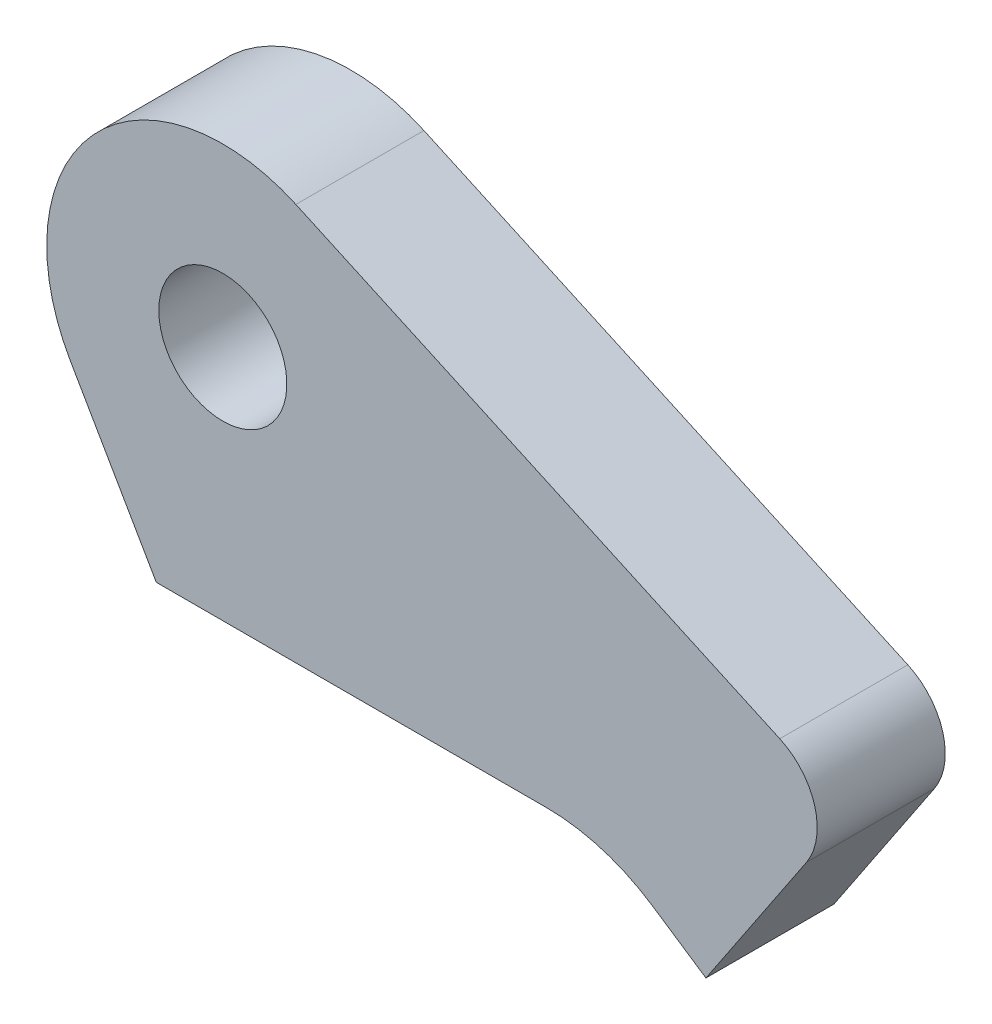
ISO-10303-21;
HEADER;
FILE_DESCRIPTION(('STEP AP214'),'2;1');
FILE_NAME('part.step','',(''),(''),'','','');
FILE_SCHEMA(('AUTOMOTIVE_DESIGN { 1 0 10303 214 1 1 1 1 }'));
ENDSEC;
DATA;
#1=APPLICATION_CONTEXT('core data for automotive mechanical design processes');
#2=APPLICATION_PROTOCOL_DEFINITION('international standard','automotive_design',2000,#1);
#3=PRODUCT_CONTEXT('',#1,'mechanical');
#4=PRODUCT('Part','Part','',(#3));
#5=PRODUCT_RELATED_PRODUCT_CATEGORY('part','',(#4));
#6=PRODUCT_DEFINITION_FORMATION('','',#4);
#7=PRODUCT_DEFINITION_CONTEXT('part definition',#1,'design');
#8=PRODUCT_DEFINITION('design','',#6,#7);
#9=PRODUCT_DEFINITION_SHAPE('','',#8);
#10=(LENGTH_UNIT() NAMED_UNIT(*) SI_UNIT(.MILLI.,.METRE.));
#11=(NAMED_UNIT(*) PLANE_ANGLE_UNIT() SI_UNIT($,.RADIAN.));
#12=(NAMED_UNIT(*) SI_UNIT($,.STERADIAN.) SOLID_ANGLE_UNIT());
#13=UNCERTAINTY_MEASURE_WITH_UNIT(LENGTH_MEASURE(1.E-05),#10,'distance_accuracy_value','');
#14=(GEOMETRIC_REPRESENTATION_CONTEXT(3) GLOBAL_UNCERTAINTY_ASSIGNED_CONTEXT((#13)) GLOBAL_UNIT_ASSIGNED_CONTEXT((#10,
#11,#12)) REPRESENTATION_CONTEXT('',''));
#15=CARTESIAN_POINT('',(0.,0.,0.));
#16=DIRECTION('',(0.,0.,1.));
#17=DIRECTION('',(1.,0.,0.));
#18=AXIS2_PLACEMENT_3D('',#15,#16,#17);
#19=CARTESIAN_POINT('',(17.1452411826871,27.7177924561188,-10.));
#20=DIRECTION('',(0.55573737135744,0.831357909733662,0.));
#21=DIRECTION('',(-0.831357909733662,0.55573737135744,0.));
#22=AXIS2_PLACEMENT_3D('',#19,#20,#21);
#23=PLANE('',#22);
#24=DIRECTION('',(-0.831357909733662,0.55573737135744,0.));
#25=VECTOR('',#24,1.);
#26=CARTESIAN_POINT('',(17.1452411826871,27.7177924561188,0.));
#27=LINE('',#26,#25);
#28=CARTESIAN_POINT('',(17.1452411826871,27.7177924561188,0.));
#29=VERTEX_POINT('',#28);
#30=CARTESIAN_POINT('',(13.0024867440047,30.4870972705402,0.));
#31=VERTEX_POINT('',#30);
#32=EDGE_CURVE('E121',#29,#31,#27,.T.);
#33=ORIENTED_EDGE('',*,*,#32,.T.);
#34=DIRECTION('',(0.,0.,1.));
#35=VECTOR('',#34,1.);
#36=CARTESIAN_POINT('',(13.0024867440047,30.4870972705402,-10.));
#37=LINE('',#36,#35);
#38=CARTESIAN_POINT('',(13.0024867440047,30.4870972705402,-10.));
#39=VERTEX_POINT('',#38);
#40=EDGE_CURVE('E103',#39,#31,#37,.T.);
#41=ORIENTED_EDGE('',*,*,#40,.F.);
#42=DIRECTION('',(-0.831357909733662,0.55573737135744,0.));
#43=VECTOR('',#42,1.);
#44=CARTESIAN_POINT('',(17.1452411826871,27.7177924561188,-10.));
#45=LINE('',#44,#43);
#46=CARTESIAN_POINT('',(17.1452411826871,27.7177924561188,-10.));
#47=VERTEX_POINT('',#46);
#48=EDGE_CURVE('E110',#47,#39,#45,.T.);
#49=ORIENTED_EDGE('',*,*,#48,.F.);
#50=DIRECTION('',(0.,0.,1.));
#51=VECTOR('',#50,1.);
#52=CARTESIAN_POINT('',(17.1452411826871,27.7177924561188,-10.));
#53=LINE('',#52,#51);
#54=EDGE_CURVE('E137',#47,#29,#53,.T.);
#55=ORIENTED_EDGE('',*,*,#54,.T.);
#56=EDGE_LOOP('',(#33,#41,#49,#55));
#57=FACE_BOUND('',#56,.T.);
#58=ADVANCED_FACE('F36',(#57),#23,.F.);
#59=CARTESIAN_POINT('',(4.6664261736431,18.0167286245353,-10.));
#60=DIRECTION('',(0.,0.,1.));
#61=DIRECTION('',(1.,0.,0.));
#62=AXIS2_PLACEMENT_3D('',#59,#60,#61);
#63=CYLINDRICAL_SURFACE('',#62,15.);
#64=CARTESIAN_POINT('',(4.6664261736431,18.0167286245353,0.));
#65=DIRECTION('',(0.,0.,1.));
#66=DIRECTION('',(1.,0.,0.));
#67=AXIS2_PLACEMENT_3D('',#64,#65,#66);
#68=CIRCLE('',#67,15.);
#69=CARTESIAN_POINT('',(4.6664261736431,33.0167286245352,0.));
#70=VERTEX_POINT('',#69);
#71=EDGE_CURVE('E151',#31,#70,#68,.T.);
#72=ORIENTED_EDGE('',*,*,#71,.T.);
#73=DIRECTION('',(0.,0.,1.));
#74=VECTOR('',#73,1.);
#75=CARTESIAN_POINT('',(4.6664261736431,33.0167286245352,-10.));
#76=LINE('',#75,#74);
#77=CARTESIAN_POINT('',(4.6664261736431,33.0167286245352,-10.));
#78=VERTEX_POINT('',#77);
#79=EDGE_CURVE('E106',#78,#70,#76,.T.);
#80=ORIENTED_EDGE('',*,*,#79,.F.);
#81=CARTESIAN_POINT('',(4.6664261736431,18.0167286245353,-10.));
#82=DIRECTION('',(0.,0.,1.));
#83=DIRECTION('',(1.,0.,0.));
#84=AXIS2_PLACEMENT_3D('',#81,#82,#83);
#85=CIRCLE('',#84,15.);
#86=EDGE_CURVE('E99',#39,#78,#85,.T.);
#87=ORIENTED_EDGE('',*,*,#86,.F.);
#88=ORIENTED_EDGE('',*,*,#40,.T.);
#89=EDGE_LOOP('',(#72,#80,#87,#88));
#90=FACE_BOUND('',#89,.T.);
#91=ADVANCED_FACE('F101',(#90),#63,.F.);
#92=CARTESIAN_POINT('',(4.6664261736431,33.0167286245352,-10.));
#93=DIRECTION('',(0.,1.,0.));
#94=DIRECTION('',(-1.,0.,0.));
#95=AXIS2_PLACEMENT_3D('',#92,#93,#94);
#96=PLANE('',#95);
#97=DIRECTION('',(-1.,0.,0.));
#98=VECTOR('',#97,1.);
#99=CARTESIAN_POINT('',(4.6664261736431,33.0167286245352,0.));
#100=LINE('',#99,#98);
#101=CARTESIAN_POINT('',(-25.7817270649699,33.0167286245353,0.));
#102=VERTEX_POINT('',#101);
#103=EDGE_CURVE('E149',#70,#102,#100,.T.);
#104=ORIENTED_EDGE('',*,*,#103,.T.);
#105=DIRECTION('',(0.,0.,1.));
#106=VECTOR('',#105,1.);
#107=CARTESIAN_POINT('',(-25.7817270649699,33.0167286245353,-10.));
#108=LINE('',#107,#106);
#109=CARTESIAN_POINT('',(-25.7817270649699,33.0167286245353,-10.));
#110=VERTEX_POINT('',#109);
#111=EDGE_CURVE('E126',#110,#102,#108,.T.);
#112=ORIENTED_EDGE('',*,*,#111,.F.);
#113=DIRECTION('',(-1.,0.,0.));
#114=VECTOR('',#113,1.);
#115=CARTESIAN_POINT('',(4.6664261736431,33.0167286245352,-10.));
#116=LINE('',#115,#114);
#117=EDGE_CURVE('E109',#78,#110,#116,.T.);
#118=ORIENTED_EDGE('',*,*,#117,.F.);
#119=ORIENTED_EDGE('',*,*,#79,.T.);
#120=EDGE_LOOP('',(#104,#112,#118,#119));
#121=FACE_BOUND('',#120,.T.);
#122=ADVANCED_FACE('F193',(#121),#96,.F.);
#123=CARTESIAN_POINT('',(-25.7817270649699,33.0167286245353,-10.));
#124=DIRECTION('',(0.86602540378444,0.499999999999998,0.));
#125=DIRECTION('',(-0.499999999999998,0.86602540378444,0.));
#126=AXIS2_PLACEMENT_3D('',#123,#124,#125);
#127=PLANE('',#126);
#128=DIRECTION('',(-0.499999999999998,0.86602540378444,0.));
#129=VECTOR('',#128,1.);
#130=CARTESIAN_POINT('',(-25.7817270649699,33.0167286245353,0.));
#131=LINE('',#130,#129);
#132=CARTESIAN_POINT('',(-32.4934239442993,44.6417286245353,0.));
#133=VERTEX_POINT('',#132);
#134=EDGE_CURVE('E146',#102,#133,#131,.T.);
#135=ORIENTED_EDGE('',*,*,#134,.T.);
#136=DIRECTION('',(0.,0.,1.));
#137=VECTOR('',#136,1.);
#138=CARTESIAN_POINT('',(-32.4934239442993,44.6417286245353,-10.));
#139=LINE('',#138,#137);
#140=CARTESIAN_POINT('',(-32.4934239442993,44.6417286245353,-10.));
#141=VERTEX_POINT('',#140);
#142=EDGE_CURVE('E132',#141,#133,#139,.T.);
#143=ORIENTED_EDGE('',*,*,#142,.F.);
#144=DIRECTION('',(-0.499999999999998,0.86602540378444,0.));
#145=VECTOR('',#144,1.);
#146=CARTESIAN_POINT('',(-25.7817270649699,33.0167286245353,-10.));
#147=LINE('',#146,#145);
#148=EDGE_CURVE('E161',#110,#141,#147,.T.);
#149=ORIENTED_EDGE('',*,*,#148,.F.);
#150=ORIENTED_EDGE('',*,*,#111,.T.);
#151=EDGE_LOOP('',(#135,#143,#149,#150));
#152=FACE_BOUND('',#151,.T.);
#153=ADVANCED_FACE('F198',(#152),#127,.F.);
#154=CARTESIAN_POINT('',(-20.5855746422633,51.5167286245352,-10.));
#155=DIRECTION('',(0.,0.,1.));
#156=DIRECTION('',(1.,0.,0.));
#157=AXIS2_PLACEMENT_3D('',#154,#155,#156);
#158=CYLINDRICAL_SURFACE('',#157,13.75);
#159=CARTESIAN_POINT('',(-20.5855746422633,51.5167286245352,0.));
#160=DIRECTION('',(0.,0.,1.));
#161=DIRECTION('',(1.,0.,0.));
#162=AXIS2_PLACEMENT_3D('',#159,#160,#161);
#163=CIRCLE('',#162,13.75);
#164=CARTESIAN_POINT('',(-14.8782354518647,64.0262761529529,0.));
#165=VERTEX_POINT('',#164);
#166=EDGE_CURVE('E143',#165,#133,#163,.T.);
#167=ORIENTED_EDGE('',*,*,#166,.F.);
#168=DIRECTION('',(0.,0.,1.));
#169=VECTOR('',#168,1.);
#170=CARTESIAN_POINT('',(-14.8782354518647,64.0262761529529,-10.));
#171=LINE('',#170,#169);
#172=CARTESIAN_POINT('',(-14.8782354518647,64.0262761529529,-10.));
#173=VERTEX_POINT('',#172);
#174=EDGE_CURVE('E134',#173,#165,#171,.T.);
#175=ORIENTED_EDGE('',*,*,#174,.F.);
#176=CARTESIAN_POINT('',(-20.5855746422633,51.5167286245352,-10.));
#177=DIRECTION('',(0.,0.,1.));
#178=DIRECTION('',(1.,0.,0.));
#179=AXIS2_PLACEMENT_3D('',#176,#177,#178);
#180=CIRCLE('',#179,13.75);
#181=EDGE_CURVE('E158',#173,#141,#180,.T.);
#182=ORIENTED_EDGE('',*,*,#181,.T.);
#183=ORIENTED_EDGE('',*,*,#142,.T.);
#184=EDGE_LOOP('',(#167,#175,#182,#183));
#185=FACE_BOUND('',#184,.T.);
#186=ADVANCED_FACE('F202',(#185),#158,.T.);
#187=CARTESIAN_POINT('',(28.2599886098359,44.3449506507921,-10.));
#188=DIRECTION('',(0.415079213847171,0.909785274794011,0.));
#189=DIRECTION('',(-0.909785274794011,0.415079213847171,0.));
#190=AXIS2_PLACEMENT_3D('',#187,#188,#189);
#191=PLANE('',#190);
#192=DIRECTION('',(-0.909785274794011,0.415079213847171,0.));
#193=VECTOR('',#192,1.);
#194=CARTESIAN_POINT('',(28.2599886098359,44.3449506507921,0.));
#195=LINE('',#194,#193);
#196=CARTESIAN_POINT('',(22.9115001136198,46.7851378705541,0.));
#197=VERTEX_POINT('',#196);
#198=EDGE_CURVE('E141',#197,#165,#195,.T.);
#199=ORIENTED_EDGE('',*,*,#198,.F.);
#200=DIRECTION('',(0.,0.,1.));
#201=VECTOR('',#200,1.);
#202=CARTESIAN_POINT('',(22.9115001136198,46.7851378705541,-10.));
#203=LINE('',#202,#201);
#204=CARTESIAN_POINT('',(22.9115001136198,46.7851378705541,-10.));
#205=VERTEX_POINT('',#204);
#206=EDGE_CURVE('E44',#197,#205,#203,.F.);
#207=ORIENTED_EDGE('',*,*,#206,.T.);
#208=DIRECTION('',(-0.909785274794011,0.415079213847171,0.));
#209=VECTOR('',#208,1.);
#210=CARTESIAN_POINT('',(28.2599886098359,44.3449506507921,-10.));
#211=LINE('',#210,#209);
#212=EDGE_CURVE('E156',#205,#173,#211,.T.);
#213=ORIENTED_EDGE('',*,*,#212,.T.);
#214=ORIENTED_EDGE('',*,*,#174,.T.);
#215=EDGE_LOOP('',(#199,#207,#213,#214));
#216=FACE_BOUND('',#215,.T.);
#217=ADVANCED_FACE('F186',(#216),#191,.T.);
#218=CARTESIAN_POINT('',(17.1452411826871,27.7177924561188,-10.));
#219=DIRECTION('',(0.831357909733662,-0.55573737135744,0.));
#220=DIRECTION('',(0.55573737135744,0.831357909733662,0.));
#221=AXIS2_PLACEMENT_3D('',#218,#219,#220);
#222=PLANE('',#221);
#223=DIRECTION('',(0.55573737135744,0.831357909733662,0.));
#224=VECTOR('',#223,1.);
#225=CARTESIAN_POINT('',(17.1452411826871,27.7177924561188,-10.));
#226=LINE('',#225,#224);
#227=CARTESIAN_POINT('',(24.9928935930523,39.4575246397968,-10.));
#228=VERTEX_POINT('',#227);
#229=EDGE_CURVE('E116',#47,#228,#226,.T.);
#230=ORIENTED_EDGE('',*,*,#229,.T.);
#231=DIRECTION('',(0.,0.,1.));
#232=VECTOR('',#231,1.);
#233=CARTESIAN_POINT('',(24.9928935930523,39.4575246397968,-10.));
#234=LINE('',#233,#232);
#235=CARTESIAN_POINT('',(24.9928935930523,39.4575246397968,0.));
#236=VERTEX_POINT('',#235);
#237=EDGE_CURVE('E122',#228,#236,#234,.T.);
#238=ORIENTED_EDGE('',*,*,#237,.T.);
#239=DIRECTION('',(0.55573737135744,0.831357909733662,0.));
#240=VECTOR('',#239,1.);
#241=CARTESIAN_POINT('',(17.1452411826871,27.7177924561188,0.));
#242=LINE('',#241,#240);
#243=EDGE_CURVE('E118',#29,#236,#242,.T.);
#244=ORIENTED_EDGE('',*,*,#243,.F.);
#245=ORIENTED_EDGE('',*,*,#54,.F.);
#246=EDGE_LOOP('',(#230,#238,#244,#245));
#247=FACE_BOUND('',#246,.T.);
#248=ADVANCED_FACE('F179',(#247),#222,.T.);
#249=CARTESIAN_POINT('',(4.6664261736431,18.0167286245353,-10.));
#250=DIRECTION('',(0.,0.,1.));
#251=DIRECTION('',(1.,0.,0.));
#252=AXIS2_PLACEMENT_3D('',#249,#250,#251);
#253=PLANE('',#252);
#254=CARTESIAN_POINT('',(-20.5855746422633,51.5167286245353,-10.));
#255=DIRECTION('',(0.,0.,-1.));
#256=DIRECTION('',(-1.,0.,0.));
#257=AXIS2_PLACEMENT_3D('',#254,#255,#256);
#258=CIRCLE('',#257,5.);
#259=CARTESIAN_POINT('',(-25.5855746422633,51.5167286245353,-10.));
#260=VERTEX_POINT('',#259);
#261=EDGE_CURVE('E164',#260,#260,#258,.T.);
#262=ORIENTED_EDGE('',*,*,#261,.F.);
#263=EDGE_LOOP('',(#262));
#264=FACE_BOUND('',#263,.T.);
#265=ORIENTED_EDGE('',*,*,#212,.F.);
#266=CARTESIAN_POINT('',(20.8361040443839,42.236211496584,-10.));
#267=DIRECTION('',(0.,0.,1.));
#268=DIRECTION('',(1.,0.,0.));
#269=AXIS2_PLACEMENT_3D('',#266,#267,#268);
#270=CIRCLE('',#269,5.);
#271=EDGE_CURVE('E11',#205,#228,#270,.F.);
#272=ORIENTED_EDGE('',*,*,#271,.T.);
#273=ORIENTED_EDGE('',*,*,#229,.F.);
#274=ORIENTED_EDGE('',*,*,#48,.T.);
#275=ORIENTED_EDGE('',*,*,#86,.T.);
#276=ORIENTED_EDGE('',*,*,#117,.T.);
#277=ORIENTED_EDGE('',*,*,#148,.T.);
#278=ORIENTED_EDGE('',*,*,#181,.F.);
#279=EDGE_LOOP('',(#265,#272,#273,#274,#275,#276,#277,#278));
#280=FACE_BOUND('',#279,.T.);
#281=ADVANCED_FACE('F114',(#264,#280),#253,.F.);
#282=CARTESIAN_POINT('',(4.6664261736431,18.0167286245353,0.));
#283=DIRECTION('',(0.,0.,1.));
#284=DIRECTION('',(1.,0.,0.));
#285=AXIS2_PLACEMENT_3D('',#282,#283,#284);
#286=PLANE('',#285);
#287=CARTESIAN_POINT('',(-20.5855746422633,51.5167286245353,0.));
#288=DIRECTION('',(0.,0.,-1.));
#289=DIRECTION('',(-1.,0.,0.));
#290=AXIS2_PLACEMENT_3D('',#287,#288,#289);
#291=CIRCLE('',#290,5.);
#292=CARTESIAN_POINT('',(-25.5855746422633,51.5167286245353,0.));
#293=VERTEX_POINT('',#292);
#294=EDGE_CURVE('E154',#293,#293,#291,.T.);
#295=ORIENTED_EDGE('',*,*,#294,.T.);
#296=EDGE_LOOP('',(#295));
#297=FACE_BOUND('',#296,.T.);
#298=ORIENTED_EDGE('',*,*,#243,.T.);
#299=CARTESIAN_POINT('',(20.8361040443839,42.236211496584,0.));
#300=DIRECTION('',(0.,0.,1.));
#301=DIRECTION('',(1.,0.,0.));
#302=AXIS2_PLACEMENT_3D('',#299,#300,#301);
#303=CIRCLE('',#302,5.);
#304=EDGE_CURVE('E58',#236,#197,#303,.T.);
#305=ORIENTED_EDGE('',*,*,#304,.T.);
#306=ORIENTED_EDGE('',*,*,#198,.T.);
#307=ORIENTED_EDGE('',*,*,#166,.T.);
#308=ORIENTED_EDGE('',*,*,#134,.F.);
#309=ORIENTED_EDGE('',*,*,#103,.F.);
#310=ORIENTED_EDGE('',*,*,#71,.F.);
#311=ORIENTED_EDGE('',*,*,#32,.F.);
#312=EDGE_LOOP('',(#298,#305,#306,#307,#308,#309,#310,#311));
#313=FACE_BOUND('',#312,.T.);
#314=ADVANCED_FACE('F170',(#297,#313),#286,.T.);
#315=CARTESIAN_POINT('',(-20.5855746422633,51.5167286245353,0.));
#316=DIRECTION('',(0.,0.,-1.));
#317=DIRECTION('',(-1.,0.,0.));
#318=AXIS2_PLACEMENT_3D('',#315,#316,#317);
#319=CYLINDRICAL_SURFACE('',#318,5.);
#320=ORIENTED_EDGE('',*,*,#294,.F.);
#321=EDGE_LOOP('',(#320));
#322=FACE_BOUND('',#321,.T.);
#323=ORIENTED_EDGE('',*,*,#261,.T.);
#324=EDGE_LOOP('',(#323));
#325=FACE_BOUND('',#324,.T.);
#326=ADVANCED_FACE('F172',(#322,#325),#319,.F.);
#327=CARTESIAN_POINT('',(20.8361040443839,42.236211496584,-10.));
#328=DIRECTION('',(0.,0.,1.));
#329=DIRECTION('',(1.,0.,0.));
#330=AXIS2_PLACEMENT_3D('',#327,#328,#329);
#331=CYLINDRICAL_SURFACE('',#330,5.);
#332=ORIENTED_EDGE('',*,*,#271,.F.);
#333=ORIENTED_EDGE('',*,*,#206,.F.);
#334=ORIENTED_EDGE('',*,*,#304,.F.);
#335=ORIENTED_EDGE('',*,*,#237,.F.);
#336=EDGE_LOOP('',(#332,#333,#334,#335));
#337=FACE_BOUND('',#336,.T.);
#338=ADVANCED_FACE('F38',(#337),#331,.T.);
#339=CLOSED_SHELL('',(#58,#91,#122,#153,#186,#217,#248,#281,#314,#326,#338));
#340=MANIFOLD_SOLID_BREP('B2',#339);
#341=ADVANCED_BREP_SHAPE_REPRESENTATION('',(#18,#340),#14);
#342=SHAPE_DEFINITION_REPRESENTATION(#9,#341);
ENDSEC;
END-ISO-10303-21;
